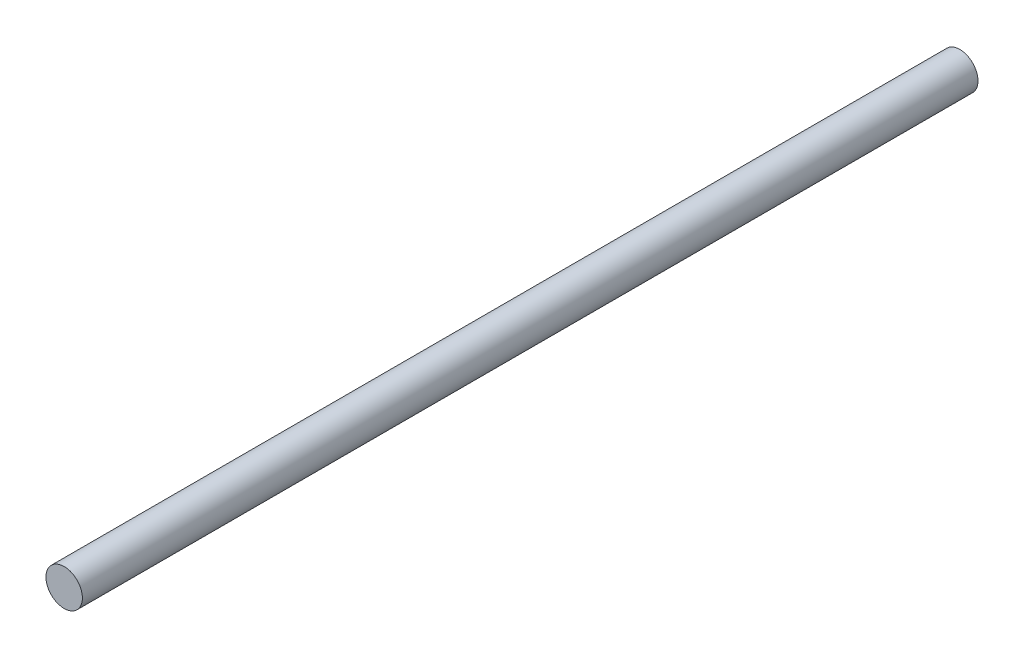
ISO-10303-21;
HEADER;
FILE_DESCRIPTION(('STEP AP214'),'2;1');
FILE_NAME('part.step','',(''),(''),'','','');
FILE_SCHEMA(('AUTOMOTIVE_DESIGN { 1 0 10303 214 1 1 1 1 }'));
ENDSEC;
DATA;
#1=APPLICATION_CONTEXT('core data for automotive mechanical design processes');
#2=APPLICATION_PROTOCOL_DEFINITION('international standard','automotive_design',2000,#1);
#3=PRODUCT_CONTEXT('',#1,'mechanical');
#4=PRODUCT('Part','Part','',(#3));
#5=PRODUCT_RELATED_PRODUCT_CATEGORY('part','',(#4));
#6=PRODUCT_DEFINITION_FORMATION('','',#4);
#7=PRODUCT_DEFINITION_CONTEXT('part definition',#1,'design');
#8=PRODUCT_DEFINITION('design','',#6,#7);
#9=PRODUCT_DEFINITION_SHAPE('','',#8);
#10=(LENGTH_UNIT() NAMED_UNIT(*) SI_UNIT(.MILLI.,.METRE.));
#11=(NAMED_UNIT(*) PLANE_ANGLE_UNIT() SI_UNIT($,.RADIAN.));
#12=(NAMED_UNIT(*) SI_UNIT($,.STERADIAN.) SOLID_ANGLE_UNIT());
#13=UNCERTAINTY_MEASURE_WITH_UNIT(LENGTH_MEASURE(1.E-05),#10,'distance_accuracy_value','');
#14=(GEOMETRIC_REPRESENTATION_CONTEXT(3) GLOBAL_UNCERTAINTY_ASSIGNED_CONTEXT((#13)) GLOBAL_UNIT_ASSIGNED_CONTEXT((#10,
#11,#12)) REPRESENTATION_CONTEXT('',''));
#15=CARTESIAN_POINT('',(0.,0.,0.));
#16=DIRECTION('',(0.,0.,1.));
#17=DIRECTION('',(1.,0.,0.));
#18=AXIS2_PLACEMENT_3D('',#15,#16,#17);
#19=CARTESIAN_POINT('',(0.,0.,123.));
#20=DIRECTION('',(0.,0.,-1.));
#21=DIRECTION('',(-1.,0.,0.));
#22=AXIS2_PLACEMENT_3D('',#19,#20,#21);
#23=CYLINDRICAL_SURFACE('',#22,2.5);
#24=CARTESIAN_POINT('',(0.,0.,123.));
#25=DIRECTION('',(0.,0.,1.));
#26=DIRECTION('',(1.,0.,0.));
#27=AXIS2_PLACEMENT_3D('',#24,#25,#26);
#28=CIRCLE('',#27,2.5);
#29=CARTESIAN_POINT('',(2.5,0.,123.));
#30=VERTEX_POINT('',#29);
#31=EDGE_CURVE('E10',#30,#30,#28,.T.);
#32=ORIENTED_EDGE('',*,*,#31,.F.);
#33=EDGE_LOOP('',(#32));
#34=FACE_BOUND('',#33,.T.);
#35=CARTESIAN_POINT('',(0.,0.,0.));
#36=DIRECTION('',(0.,0.,1.));
#37=DIRECTION('',(1.,0.,0.));
#38=AXIS2_PLACEMENT_3D('',#35,#36,#37);
#39=CIRCLE('',#38,2.5);
#40=CARTESIAN_POINT('',(2.5,0.,0.));
#41=VERTEX_POINT('',#40);
#42=EDGE_CURVE('E37',#41,#41,#39,.T.);
#43=ORIENTED_EDGE('',*,*,#42,.T.);
#44=EDGE_LOOP('',(#43));
#45=FACE_BOUND('',#44,.T.);
#46=ADVANCED_FACE('F31',(#34,#45),#23,.T.);
#47=CARTESIAN_POINT('',(0.,0.,123.));
#48=DIRECTION('',(0.,0.,1.));
#49=DIRECTION('',(1.,0.,0.));
#50=AXIS2_PLACEMENT_3D('',#47,#48,#49);
#51=PLANE('',#50);
#52=ORIENTED_EDGE('',*,*,#31,.T.);
#53=EDGE_LOOP('',(#52));
#54=FACE_BOUND('',#53,.T.);
#55=ADVANCED_FACE('F46',(#54),#51,.T.);
#56=CARTESIAN_POINT('',(0.,0.,0.));
#57=DIRECTION('',(0.,0.,1.));
#58=DIRECTION('',(1.,0.,0.));
#59=AXIS2_PLACEMENT_3D('',#56,#57,#58);
#60=PLANE('',#59);
#61=ORIENTED_EDGE('',*,*,#42,.F.);
#62=EDGE_LOOP('',(#61));
#63=FACE_BOUND('',#62,.T.);
#64=ADVANCED_FACE('F44',(#63),#60,.F.);
#65=CLOSED_SHELL('',(#46,#55,#64));
#66=MANIFOLD_SOLID_BREP('B2',#65);
#67=ADVANCED_BREP_SHAPE_REPRESENTATION('',(#18,#66),#14);
#68=SHAPE_DEFINITION_REPRESENTATION(#9,#67);
ENDSEC;
END-ISO-10303-21;
